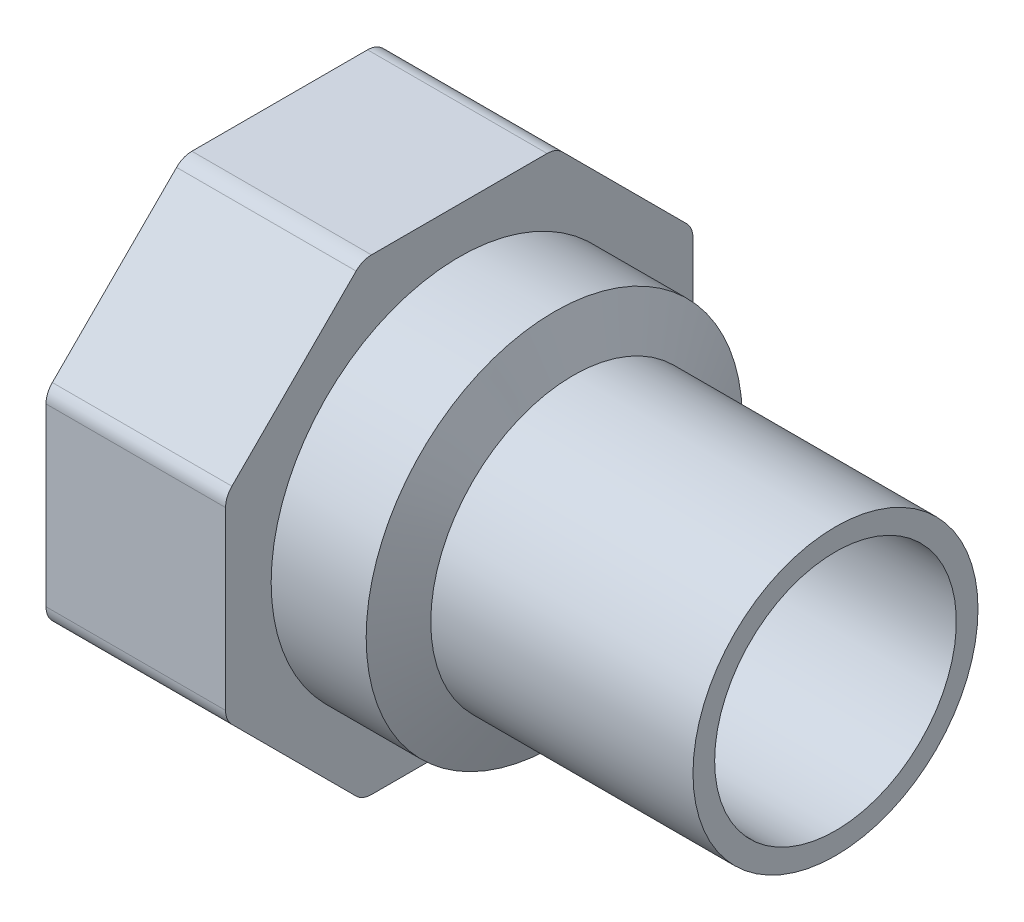
ISO-10303-21;
HEADER;
FILE_DESCRIPTION(('STEP AP214'),'2;1');
FILE_NAME('part.step','',(''),(''),'','','');
FILE_SCHEMA(('AUTOMOTIVE_DESIGN { 1 0 10303 214 1 1 1 1 }'));
ENDSEC;
DATA;
#1=APPLICATION_CONTEXT('core data for automotive mechanical design processes');
#2=APPLICATION_PROTOCOL_DEFINITION('international standard','automotive_design',2000,#1);
#3=PRODUCT_CONTEXT('',#1,'mechanical');
#4=PRODUCT('Part','Part','',(#3));
#5=PRODUCT_RELATED_PRODUCT_CATEGORY('part','',(#4));
#6=PRODUCT_DEFINITION_FORMATION('','',#4);
#7=PRODUCT_DEFINITION_CONTEXT('part definition',#1,'design');
#8=PRODUCT_DEFINITION('design','',#6,#7);
#9=PRODUCT_DEFINITION_SHAPE('','',#8);
#10=(LENGTH_UNIT() NAMED_UNIT(*) SI_UNIT(.MILLI.,.METRE.));
#11=(NAMED_UNIT(*) PLANE_ANGLE_UNIT() SI_UNIT($,.RADIAN.));
#12=(NAMED_UNIT(*) SI_UNIT($,.STERADIAN.) SOLID_ANGLE_UNIT());
#13=UNCERTAINTY_MEASURE_WITH_UNIT(LENGTH_MEASURE(1.E-05),#10,'distance_accuracy_value','');
#14=(GEOMETRIC_REPRESENTATION_CONTEXT(3) GLOBAL_UNCERTAINTY_ASSIGNED_CONTEXT((#13)) GLOBAL_UNIT_ASSIGNED_CONTEXT((#10,
#11,#12)) REPRESENTATION_CONTEXT('',''));
#15=CARTESIAN_POINT('',(0.,0.,0.));
#16=DIRECTION('',(0.,0.,1.));
#17=DIRECTION('',(1.,0.,0.));
#18=AXIS2_PLACEMENT_3D('',#15,#16,#17);
#19=CARTESIAN_POINT('',(-23.,0.,0.));
#20=DIRECTION('',(-1.,0.,0.));
#21=DIRECTION('',(0.,0.,1.));
#22=AXIS2_PLACEMENT_3D('',#19,#20,#21);
#23=CYLINDRICAL_SURFACE('',#22,12.5);
#24=CARTESIAN_POINT('',(-23.,0.,0.));
#25=DIRECTION('',(1.,0.,0.));
#26=DIRECTION('',(0.,1.,0.));
#27=AXIS2_PLACEMENT_3D('',#24,#25,#26);
#28=CIRCLE('',#27,12.5);
#29=CARTESIAN_POINT('',(-23.,12.5,0.));
#30=VERTEX_POINT('',#29);
#31=EDGE_CURVE('E317',#30,#30,#28,.F.);
#32=ORIENTED_EDGE('',*,*,#31,.F.);
#33=EDGE_LOOP('',(#32));
#34=FACE_BOUND('',#33,.T.);
#35=CARTESIAN_POINT('',(0.,0.,0.));
#36=DIRECTION('',(-1.,0.,0.));
#37=DIRECTION('',(0.,0.,1.));
#38=AXIS2_PLACEMENT_3D('',#35,#36,#37);
#39=CIRCLE('',#38,12.5);
#40=CARTESIAN_POINT('',(0.,0.,12.5));
#41=VERTEX_POINT('',#40);
#42=EDGE_CURVE('E18',#41,#41,#39,.F.);
#43=ORIENTED_EDGE('',*,*,#42,.F.);
#44=EDGE_LOOP('',(#43));
#45=FACE_BOUND('',#44,.T.);
#46=ADVANCED_FACE('F15',(#34,#45),#23,.T.);
#47=CARTESIAN_POINT('',(-23.,0.,0.));
#48=DIRECTION('',(-1.,0.,0.));
#49=DIRECTION('',(0.,0.,1.));
#50=AXIS2_PLACEMENT_3D('',#47,#48,#49);
#51=CONICAL_SURFACE('',#50,12.5,1.17600520709513);
#52=CARTESIAN_POINT('',(-24.6666666666667,0.,0.));
#53=DIRECTION('',(-1.,0.,0.));
#54=DIRECTION('',(0.,1.,0.));
#55=AXIS2_PLACEMENT_3D('',#52,#53,#54);
#56=CIRCLE('',#55,16.5);
#57=CARTESIAN_POINT('',(-24.6666666666667,16.5,0.));
#58=VERTEX_POINT('',#57);
#59=EDGE_CURVE('E309',#58,#58,#56,.T.);
#60=ORIENTED_EDGE('',*,*,#59,.F.);
#61=EDGE_LOOP('',(#60));
#62=FACE_BOUND('',#61,.T.);
#63=ORIENTED_EDGE('',*,*,#31,.T.);
#64=EDGE_LOOP('',(#63));
#65=FACE_BOUND('',#64,.T.);
#66=ADVANCED_FACE('F548',(#62,#65),#51,.T.);
#67=CARTESIAN_POINT('',(0.,12.5,12.6500021083112));
#68=DIRECTION('',(1.,0.,0.));
#69=DIRECTION('',(0.,-1.,0.));
#70=AXIS2_PLACEMENT_3D('',#67,#68,#69);
#71=PLANE('',#70);
#72=CARTESIAN_POINT('',(0.,0.,0.));
#73=DIRECTION('',(-1.,0.,0.));
#74=DIRECTION('',(0.,0.,1.));
#75=AXIS2_PLACEMENT_3D('',#72,#73,#74);
#76=CIRCLE('',#75,10.6);
#77=CARTESIAN_POINT('',(0.,0.,10.6));
#78=VERTEX_POINT('',#77);
#79=EDGE_CURVE('E137',#78,#78,#76,.F.);
#80=ORIENTED_EDGE('',*,*,#79,.F.);
#81=EDGE_LOOP('',(#80));
#82=FACE_BOUND('',#81,.T.);
#83=ORIENTED_EDGE('',*,*,#42,.T.);
#84=EDGE_LOOP('',(#83));
#85=FACE_BOUND('',#84,.T.);
#86=ADVANCED_FACE('F540',(#82,#85),#71,.T.);
#87=CARTESIAN_POINT('',(-33.,0.,0.));
#88=DIRECTION('',(-1.,0.,0.));
#89=DIRECTION('',(0.,0.,1.));
#90=AXIS2_PLACEMENT_3D('',#87,#88,#89);
#91=CYLINDRICAL_SURFACE('',#90,16.5);
#92=CARTESIAN_POINT('',(-33.,0.,0.));
#93=DIRECTION('',(-1.,0.,0.));
#94=DIRECTION('',(0.,0.,1.));
#95=AXIS2_PLACEMENT_3D('',#92,#93,#94);
#96=CIRCLE('',#95,16.5);
#97=CARTESIAN_POINT('',(-33.,0.,16.5));
#98=VERTEX_POINT('',#97);
#99=EDGE_CURVE('E285',#98,#98,#96,.T.);
#100=ORIENTED_EDGE('',*,*,#99,.F.);
#101=EDGE_LOOP('',(#100));
#102=FACE_BOUND('',#101,.T.);
#103=ORIENTED_EDGE('',*,*,#59,.T.);
#104=EDGE_LOOP('',(#103));
#105=FACE_BOUND('',#104,.T.);
#106=ADVANCED_FACE('F533',(#102,#105),#91,.T.);
#107=CARTESIAN_POINT('',(0.,0.,0.));
#108=DIRECTION('',(-1.,0.,0.));
#109=DIRECTION('',(0.,0.,1.));
#110=AXIS2_PLACEMENT_3D('',#107,#108,#109);
#111=CYLINDRICAL_SURFACE('',#110,10.6);
#112=ORIENTED_EDGE('',*,*,#79,.T.);
#113=EDGE_LOOP('',(#112));
#114=FACE_BOUND('',#113,.T.);
#115=CARTESIAN_POINT('',(-32.725923743948,0.,0.));
#116=DIRECTION('',(1.,0.,0.));
#117=DIRECTION('',(0.,1.,0.));
#118=AXIS2_PLACEMENT_3D('',#115,#116,#117);
#119=CIRCLE('',#118,10.6);
#120=CARTESIAN_POINT('',(-32.725923743948,10.6,0.));
#121=VERTEX_POINT('',#120);
#122=EDGE_CURVE('E165',#121,#121,#119,.T.);
#123=ORIENTED_EDGE('',*,*,#122,.F.);
#124=EDGE_LOOP('',(#123));
#125=FACE_BOUND('',#124,.T.);
#126=ADVANCED_FACE('F526',(#114,#125),#111,.F.);
#127=CARTESIAN_POINT('',(-33.,7.70437226013957,18.6));
#128=DIRECTION('',(1.,0.,0.));
#129=DIRECTION('',(0.,0.,-1.));
#130=AXIS2_PLACEMENT_3D('',#127,#128,#129);
#131=CYLINDRICAL_SURFACE('',#130,1.89999999999997);
#132=CARTESIAN_POINT('',(-48.75,7.70437226013957,18.6));
#133=DIRECTION('',(1.,0.,0.));
#134=DIRECTION('',(0.,0.,-1.));
#135=AXIS2_PLACEMENT_3D('',#132,#133,#134);
#136=CIRCLE('',#135,1.89999999999997);
#137=CARTESIAN_POINT('',(-48.75,9.047875144394,19.9435028842544));
#138=VERTEX_POINT('',#137);
#139=CARTESIAN_POINT('',(-48.75,7.70437226013957,20.5));
#140=VERTEX_POINT('',#139);
#141=EDGE_CURVE('E125',#138,#140,#136,.T.);
#142=ORIENTED_EDGE('',*,*,#141,.T.);
#143=DIRECTION('',(1.,0.,0.));
#144=VECTOR('',#143,1.);
#145=CARTESIAN_POINT('',(-48.75,7.70437226013956,20.5));
#146=LINE('',#145,#144);
#147=CARTESIAN_POINT('',(-33.,7.70437226013957,20.5));
#148=VERTEX_POINT('',#147);
#149=EDGE_CURVE('E131',#148,#140,#146,.F.);
#150=ORIENTED_EDGE('',*,*,#149,.F.);
#151=CARTESIAN_POINT('',(-33.,7.70437226013957,18.6));
#152=DIRECTION('',(1.,0.,0.));
#153=DIRECTION('',(0.,0.,-1.));
#154=AXIS2_PLACEMENT_3D('',#151,#152,#153);
#155=CIRCLE('',#154,1.89999999999997);
#156=CARTESIAN_POINT('',(-33.,9.04787514439399,19.9435028842544));
#157=VERTEX_POINT('',#156);
#158=EDGE_CURVE('E288',#157,#148,#155,.T.);
#159=ORIENTED_EDGE('',*,*,#158,.F.);
#160=DIRECTION('',(1.,0.,0.));
#161=VECTOR('',#160,1.);
#162=CARTESIAN_POINT('',(-48.75,9.047875144394,19.9435028842544));
#163=LINE('',#162,#161);
#164=EDGE_CURVE('E134',#138,#157,#163,.T.);
#165=ORIENTED_EDGE('',*,*,#164,.F.);
#166=EDGE_LOOP('',(#142,#150,#159,#165));
#167=FACE_BOUND('',#166,.T.);
#168=ADVANCED_FACE('F130',(#167),#131,.T.);
#169=CARTESIAN_POINT('',(-33.,18.6,7.70437226013958));
#170=DIRECTION('',(1.,0.,0.));
#171=DIRECTION('',(0.,0.,-1.));
#172=AXIS2_PLACEMENT_3D('',#169,#170,#171);
#173=CYLINDRICAL_SURFACE('',#172,1.89999999999999);
#174=CARTESIAN_POINT('',(-48.75,18.6,7.70437226013958));
#175=DIRECTION('',(1.,0.,0.));
#176=DIRECTION('',(0.,0.,-1.));
#177=AXIS2_PLACEMENT_3D('',#174,#175,#176);
#178=CIRCLE('',#177,1.89999999999999);
#179=CARTESIAN_POINT('',(-48.75,20.5,7.70437226013957));
#180=VERTEX_POINT('',#179);
#181=CARTESIAN_POINT('',(-48.75,19.9435028842544,9.04787514439401));
#182=VERTEX_POINT('',#181);
#183=EDGE_CURVE('E136',#180,#182,#178,.T.);
#184=ORIENTED_EDGE('',*,*,#183,.T.);
#185=DIRECTION('',(1.,0.,0.));
#186=VECTOR('',#185,1.);
#187=CARTESIAN_POINT('',(-48.75,19.9435028842544,9.04787514439401));
#188=LINE('',#187,#186);
#189=CARTESIAN_POINT('',(-33.,19.9435028842544,9.04787514439401));
#190=VERTEX_POINT('',#189);
#191=EDGE_CURVE('E170',#190,#182,#188,.F.);
#192=ORIENTED_EDGE('',*,*,#191,.F.);
#193=CARTESIAN_POINT('',(-33.,18.6,7.70437226013958));
#194=DIRECTION('',(1.,0.,0.));
#195=DIRECTION('',(0.,0.,-1.));
#196=AXIS2_PLACEMENT_3D('',#193,#194,#195);
#197=CIRCLE('',#196,1.89999999999999);
#198=CARTESIAN_POINT('',(-33.,20.5,7.70437226013957));
#199=VERTEX_POINT('',#198);
#200=EDGE_CURVE('E290',#199,#190,#197,.T.);
#201=ORIENTED_EDGE('',*,*,#200,.F.);
#202=DIRECTION('',(1.,0.,0.));
#203=VECTOR('',#202,1.);
#204=CARTESIAN_POINT('',(-48.75,20.5,7.70437226013956));
#205=LINE('',#204,#203);
#206=EDGE_CURVE('E178',#180,#199,#205,.T.);
#207=ORIENTED_EDGE('',*,*,#206,.F.);
#208=EDGE_LOOP('',(#184,#192,#201,#207));
#209=FACE_BOUND('',#208,.T.);
#210=ADVANCED_FACE('F511',(#209),#173,.T.);
#211=CARTESIAN_POINT('',(-33.,18.6,-7.70437226013955));
#212=DIRECTION('',(1.,0.,0.));
#213=DIRECTION('',(0.,0.,-1.));
#214=AXIS2_PLACEMENT_3D('',#211,#212,#213);
#215=CYLINDRICAL_SURFACE('',#214,1.89999999999999);
#216=CARTESIAN_POINT('',(-48.75,18.6,-7.70437226013955));
#217=DIRECTION('',(1.,0.,0.));
#218=DIRECTION('',(0.,0.,-1.));
#219=AXIS2_PLACEMENT_3D('',#216,#217,#218);
#220=CIRCLE('',#219,1.89999999999999);
#221=CARTESIAN_POINT('',(-48.75,19.9435028842544,-9.04787514439398));
#222=VERTEX_POINT('',#221);
#223=CARTESIAN_POINT('',(-48.75,20.5,-7.70437226013955));
#224=VERTEX_POINT('',#223);
#225=EDGE_CURVE('E306',#222,#224,#220,.T.);
#226=ORIENTED_EDGE('',*,*,#225,.T.);
#227=DIRECTION('',(1.,0.,0.));
#228=VECTOR('',#227,1.);
#229=CARTESIAN_POINT('',(-48.75,20.5,-7.70437226013955));
#230=LINE('',#229,#228);
#231=CARTESIAN_POINT('',(-33.,20.5,-7.70437226013955));
#232=VERTEX_POINT('',#231);
#233=EDGE_CURVE('E177',#232,#224,#230,.F.);
#234=ORIENTED_EDGE('',*,*,#233,.F.);
#235=CARTESIAN_POINT('',(-33.,18.6,-7.70437226013955));
#236=DIRECTION('',(1.,0.,0.));
#237=DIRECTION('',(0.,0.,-1.));
#238=AXIS2_PLACEMENT_3D('',#235,#236,#237);
#239=CIRCLE('',#238,1.89999999999999);
#240=CARTESIAN_POINT('',(-33.,19.9435028842544,-9.04787514439398));
#241=VERTEX_POINT('',#240);
#242=EDGE_CURVE('E292',#241,#232,#239,.T.);
#243=ORIENTED_EDGE('',*,*,#242,.F.);
#244=DIRECTION('',(1.,0.,0.));
#245=VECTOR('',#244,1.);
#246=CARTESIAN_POINT('',(-48.75,19.9435028842544,-9.04787514439398));
#247=LINE('',#246,#245);
#248=EDGE_CURVE('E187',#222,#241,#247,.T.);
#249=ORIENTED_EDGE('',*,*,#248,.F.);
#250=EDGE_LOOP('',(#226,#234,#243,#249));
#251=FACE_BOUND('',#250,.T.);
#252=ADVANCED_FACE('F503',(#251),#215,.T.);
#253=CARTESIAN_POINT('',(-33.,7.70437226013957,-18.6));
#254=DIRECTION('',(1.,0.,0.));
#255=DIRECTION('',(0.,0.,-1.));
#256=AXIS2_PLACEMENT_3D('',#253,#254,#255);
#257=CYLINDRICAL_SURFACE('',#256,1.89999999999999);
#258=CARTESIAN_POINT('',(-48.75,7.70437226013957,-18.6));
#259=DIRECTION('',(1.,0.,0.));
#260=DIRECTION('',(0.,0.,-1.));
#261=AXIS2_PLACEMENT_3D('',#258,#259,#260);
#262=CIRCLE('',#261,1.89999999999999);
#263=CARTESIAN_POINT('',(-48.75,7.70437226013956,-20.5));
#264=VERTEX_POINT('',#263);
#265=CARTESIAN_POINT('',(-48.75,9.04787514439401,-19.9435028842544));
#266=VERTEX_POINT('',#265);
#267=EDGE_CURVE('E304',#264,#266,#262,.T.);
#268=ORIENTED_EDGE('',*,*,#267,.T.);
#269=DIRECTION('',(1.,0.,0.));
#270=VECTOR('',#269,1.);
#271=CARTESIAN_POINT('',(-48.75,9.04787514439401,-19.9435028842544));
#272=LINE('',#271,#270);
#273=CARTESIAN_POINT('',(-33.,9.047875144394,-19.9435028842544));
#274=VERTEX_POINT('',#273);
#275=EDGE_CURVE('E186',#274,#266,#272,.F.);
#276=ORIENTED_EDGE('',*,*,#275,.F.);
#277=CARTESIAN_POINT('',(-33.,7.70437226013957,-18.6));
#278=DIRECTION('',(1.,0.,0.));
#279=DIRECTION('',(0.,0.,-1.));
#280=AXIS2_PLACEMENT_3D('',#277,#278,#279);
#281=CIRCLE('',#280,1.89999999999999);
#282=CARTESIAN_POINT('',(-33.,7.70437226013957,-20.5));
#283=VERTEX_POINT('',#282);
#284=EDGE_CURVE('E294',#283,#274,#281,.T.);
#285=ORIENTED_EDGE('',*,*,#284,.F.);
#286=DIRECTION('',(1.,0.,0.));
#287=VECTOR('',#286,1.);
#288=CARTESIAN_POINT('',(-48.75,7.70437226013956,-20.5));
#289=LINE('',#288,#287);
#290=EDGE_CURVE('E196',#264,#283,#289,.T.);
#291=ORIENTED_EDGE('',*,*,#290,.F.);
#292=EDGE_LOOP('',(#268,#276,#285,#291));
#293=FACE_BOUND('',#292,.T.);
#294=ADVANCED_FACE('F495',(#293),#257,.T.);
#295=CARTESIAN_POINT('',(-33.,-7.70437226013956,-18.6));
#296=DIRECTION('',(1.,0.,0.));
#297=DIRECTION('',(0.,0.,-1.));
#298=AXIS2_PLACEMENT_3D('',#295,#296,#297);
#299=CYLINDRICAL_SURFACE('',#298,1.89999999999997);
#300=CARTESIAN_POINT('',(-48.75,-7.70437226013956,-18.6));
#301=DIRECTION('',(1.,0.,0.));
#302=DIRECTION('',(0.,0.,-1.));
#303=AXIS2_PLACEMENT_3D('',#300,#301,#302);
#304=CIRCLE('',#303,1.89999999999997);
#305=CARTESIAN_POINT('',(-48.75,-9.04787514439399,-19.9435028842544));
#306=VERTEX_POINT('',#305);
#307=CARTESIAN_POINT('',(-48.75,-7.70437226013956,-20.5));
#308=VERTEX_POINT('',#307);
#309=EDGE_CURVE('E302',#306,#308,#304,.T.);
#310=ORIENTED_EDGE('',*,*,#309,.T.);
#311=DIRECTION('',(1.,0.,0.));
#312=VECTOR('',#311,1.);
#313=CARTESIAN_POINT('',(-48.75,-7.70437226013956,-20.5));
#314=LINE('',#313,#312);
#315=CARTESIAN_POINT('',(-33.,-7.70437226013956,-20.5));
#316=VERTEX_POINT('',#315);
#317=EDGE_CURVE('E195',#316,#308,#314,.F.);
#318=ORIENTED_EDGE('',*,*,#317,.F.);
#319=CARTESIAN_POINT('',(-33.,-7.70437226013956,-18.6));
#320=DIRECTION('',(1.,0.,0.));
#321=DIRECTION('',(0.,0.,-1.));
#322=AXIS2_PLACEMENT_3D('',#319,#320,#321);
#323=CIRCLE('',#322,1.89999999999997);
#324=CARTESIAN_POINT('',(-33.,-9.04787514439398,-19.9435028842544));
#325=VERTEX_POINT('',#324);
#326=EDGE_CURVE('E296',#325,#316,#323,.T.);
#327=ORIENTED_EDGE('',*,*,#326,.F.);
#328=DIRECTION('',(1.,0.,0.));
#329=VECTOR('',#328,1.);
#330=CARTESIAN_POINT('',(-48.75,-9.04787514439399,-19.9435028842544));
#331=LINE('',#330,#329);
#332=EDGE_CURVE('E205',#306,#325,#331,.T.);
#333=ORIENTED_EDGE('',*,*,#332,.F.);
#334=EDGE_LOOP('',(#310,#318,#327,#333));
#335=FACE_BOUND('',#334,.T.);
#336=ADVANCED_FACE('F487',(#335),#299,.T.);
#337=CARTESIAN_POINT('',(-33.,-18.6,-7.70437226013958));
#338=DIRECTION('',(1.,0.,0.));
#339=DIRECTION('',(0.,0.,-1.));
#340=AXIS2_PLACEMENT_3D('',#337,#338,#339);
#341=CYLINDRICAL_SURFACE('',#340,1.89999999999999);
#342=CARTESIAN_POINT('',(-48.75,-18.6,-7.70437226013958));
#343=DIRECTION('',(1.,0.,0.));
#344=DIRECTION('',(0.,0.,-1.));
#345=AXIS2_PLACEMENT_3D('',#342,#343,#344);
#346=CIRCLE('',#345,1.89999999999999);
#347=CARTESIAN_POINT('',(-48.75,-20.5,-7.70437226013958));
#348=VERTEX_POINT('',#347);
#349=CARTESIAN_POINT('',(-48.75,-19.9435028842544,-9.04787514439401));
#350=VERTEX_POINT('',#349);
#351=EDGE_CURVE('E300',#348,#350,#346,.T.);
#352=ORIENTED_EDGE('',*,*,#351,.T.);
#353=DIRECTION('',(1.,0.,0.));
#354=VECTOR('',#353,1.);
#355=CARTESIAN_POINT('',(-48.75,-19.9435028842544,-9.04787514439402));
#356=LINE('',#355,#354);
#357=CARTESIAN_POINT('',(-33.,-19.9435028842544,-9.04787514439402));
#358=VERTEX_POINT('',#357);
#359=EDGE_CURVE('E204',#358,#350,#356,.F.);
#360=ORIENTED_EDGE('',*,*,#359,.F.);
#361=CARTESIAN_POINT('',(-33.,-18.6,-7.70437226013958));
#362=DIRECTION('',(1.,0.,0.));
#363=DIRECTION('',(0.,0.,-1.));
#364=AXIS2_PLACEMENT_3D('',#361,#362,#363);
#365=CIRCLE('',#364,1.89999999999999);
#366=CARTESIAN_POINT('',(-33.,-20.5,-7.70437226013958));
#367=VERTEX_POINT('',#366);
#368=EDGE_CURVE('E298',#367,#358,#365,.T.);
#369=ORIENTED_EDGE('',*,*,#368,.F.);
#370=DIRECTION('',(1.,0.,0.));
#371=VECTOR('',#370,1.);
#372=CARTESIAN_POINT('',(-48.75,-20.5,-7.70437226013958));
#373=LINE('',#372,#371);
#374=EDGE_CURVE('E211',#348,#367,#373,.T.);
#375=ORIENTED_EDGE('',*,*,#374,.F.);
#376=EDGE_LOOP('',(#352,#360,#369,#375));
#377=FACE_BOUND('',#376,.T.);
#378=ADVANCED_FACE('F479',(#377),#341,.T.);
#379=CARTESIAN_POINT('',(-33.,20.5,20.5));
#380=DIRECTION('',(1.,0.,0.));
#381=DIRECTION('',(0.,-1.,0.));
#382=AXIS2_PLACEMENT_3D('',#379,#380,#381);
#383=PLANE('',#382);
#384=ORIENTED_EDGE('',*,*,#99,.T.);
#385=EDGE_LOOP('',(#384));
#386=FACE_BOUND('',#385,.T.);
#387=ORIENTED_EDGE('',*,*,#158,.T.);
#388=DIRECTION('',(0.,1.,0.));
#389=VECTOR('',#388,1.);
#390=CARTESIAN_POINT('',(-33.,0.,20.5));
#391=LINE('',#390,#389);
#392=CARTESIAN_POINT('',(-33.,-7.70437226013956,20.5));
#393=VERTEX_POINT('',#392);
#394=EDGE_CURVE('E144',#393,#148,#391,.T.);
#395=ORIENTED_EDGE('',*,*,#394,.F.);
#396=CARTESIAN_POINT('',(-33.,-7.70437226013956,18.6));
#397=DIRECTION('',(1.,0.,0.));
#398=DIRECTION('',(0.,0.,-1.));
#399=AXIS2_PLACEMENT_3D('',#396,#397,#398);
#400=CIRCLE('',#399,1.89999999999999);
#401=CARTESIAN_POINT('',(-33.,-9.04787514439399,19.9435028842544));
#402=VERTEX_POINT('',#401);
#403=EDGE_CURVE('E276',#402,#393,#400,.F.);
#404=ORIENTED_EDGE('',*,*,#403,.F.);
#405=DIRECTION('',(0.,0.707106781186548,0.707106781186547));
#406=VECTOR('',#405,1.);
#407=CARTESIAN_POINT('',(-33.,-14.4956890143242,14.4956890143242));
#408=LINE('',#407,#406);
#409=CARTESIAN_POINT('',(-33.,-19.9435028842544,9.04787514439399));
#410=VERTEX_POINT('',#409);
#411=EDGE_CURVE('E164',#410,#402,#408,.T.);
#412=ORIENTED_EDGE('',*,*,#411,.F.);
#413=CARTESIAN_POINT('',(-33.,-18.6,7.70437226013955));
#414=DIRECTION('',(1.,0.,0.));
#415=DIRECTION('',(0.,0.,-1.));
#416=AXIS2_PLACEMENT_3D('',#413,#414,#415);
#417=CIRCLE('',#416,1.89999999999999);
#418=CARTESIAN_POINT('',(-33.,-20.5,7.70437226013954));
#419=VERTEX_POINT('',#418);
#420=EDGE_CURVE('E273',#419,#410,#417,.F.);
#421=ORIENTED_EDGE('',*,*,#420,.F.);
#422=DIRECTION('',(0.,0.,1.));
#423=VECTOR('',#422,1.);
#424=CARTESIAN_POINT('',(-33.,-20.5,0.));
#425=LINE('',#424,#423);
#426=EDGE_CURVE('E208',#367,#419,#425,.T.);
#427=ORIENTED_EDGE('',*,*,#426,.F.);
#428=ORIENTED_EDGE('',*,*,#368,.T.);
#429=DIRECTION('',(0.,-0.707106781186548,0.707106781186547));
#430=VECTOR('',#429,1.);
#431=CARTESIAN_POINT('',(-33.,-14.4956890143242,-14.4956890143242));
#432=LINE('',#431,#430);
#433=EDGE_CURVE('E199',#325,#358,#432,.T.);
#434=ORIENTED_EDGE('',*,*,#433,.F.);
#435=ORIENTED_EDGE('',*,*,#326,.T.);
#436=DIRECTION('',(0.,-1.,0.));
#437=VECTOR('',#436,1.);
#438=CARTESIAN_POINT('',(-33.,0.,-20.5));
#439=LINE('',#438,#437);
#440=EDGE_CURVE('E190',#283,#316,#439,.T.);
#441=ORIENTED_EDGE('',*,*,#440,.F.);
#442=ORIENTED_EDGE('',*,*,#284,.T.);
#443=DIRECTION('',(0.,-0.707106781186547,-0.707106781186548));
#444=VECTOR('',#443,1.);
#445=CARTESIAN_POINT('',(-33.,14.4956890143242,-14.4956890143242));
#446=LINE('',#445,#444);
#447=EDGE_CURVE('E181',#241,#274,#446,.T.);
#448=ORIENTED_EDGE('',*,*,#447,.F.);
#449=ORIENTED_EDGE('',*,*,#242,.T.);
#450=DIRECTION('',(0.,0.,-1.));
#451=VECTOR('',#450,1.);
#452=CARTESIAN_POINT('',(-33.,20.5,0.));
#453=LINE('',#452,#451);
#454=EDGE_CURVE('E172',#199,#232,#453,.T.);
#455=ORIENTED_EDGE('',*,*,#454,.F.);
#456=ORIENTED_EDGE('',*,*,#200,.T.);
#457=DIRECTION('',(0.,0.707106781186548,-0.707106781186547));
#458=VECTOR('',#457,1.);
#459=CARTESIAN_POINT('',(-33.,14.4956890143242,14.4956890143242));
#460=LINE('',#459,#458);
#461=EDGE_CURVE('E167',#157,#190,#460,.T.);
#462=ORIENTED_EDGE('',*,*,#461,.F.);
#463=EDGE_LOOP('',(#387,#395,#404,#412,#421,#427,#428,#434,#435,#441,#442,#448,#449,#455,#456,#462));
#464=FACE_BOUND('',#463,.T.);
#465=ADVANCED_FACE('F271',(#386,#464),#383,.T.);
#466=CARTESIAN_POINT('',(-33.,-7.70437226013956,18.6));
#467=DIRECTION('',(1.,0.,0.));
#468=DIRECTION('',(0.,0.,-1.));
#469=AXIS2_PLACEMENT_3D('',#466,#467,#468);
#470=CYLINDRICAL_SURFACE('',#469,1.89999999999999);
#471=CARTESIAN_POINT('',(-48.75,-7.70437226013956,18.6));
#472=DIRECTION('',(1.,0.,0.));
#473=DIRECTION('',(0.,0.,-1.));
#474=AXIS2_PLACEMENT_3D('',#471,#472,#473);
#475=CIRCLE('',#474,1.89999999999999);
#476=CARTESIAN_POINT('',(-48.75,-7.70437226013956,20.5));
#477=VERTEX_POINT('',#476);
#478=CARTESIAN_POINT('',(-48.75,-9.047875144394,19.9435028842544));
#479=VERTEX_POINT('',#478);
#480=EDGE_CURVE('E148',#477,#479,#475,.T.);
#481=ORIENTED_EDGE('',*,*,#480,.T.);
#482=DIRECTION('',(1.,0.,0.));
#483=VECTOR('',#482,1.);
#484=CARTESIAN_POINT('',(-48.75,-9.047875144394,19.9435028842544));
#485=LINE('',#484,#483);
#486=EDGE_CURVE('E161',#402,#479,#485,.F.);
#487=ORIENTED_EDGE('',*,*,#486,.F.);
#488=ORIENTED_EDGE('',*,*,#403,.T.);
#489=DIRECTION('',(1.,0.,0.));
#490=VECTOR('',#489,1.);
#491=CARTESIAN_POINT('',(-48.75,-7.70437226013956,20.5));
#492=LINE('',#491,#490);
#493=EDGE_CURVE('E145',#477,#393,#492,.T.);
#494=ORIENTED_EDGE('',*,*,#493,.F.);
#495=EDGE_LOOP('',(#481,#487,#488,#494));
#496=FACE_BOUND('',#495,.T.);
#497=ADVANCED_FACE('F465',(#496),#470,.T.);
#498=CARTESIAN_POINT('',(-33.,-18.6,7.70437226013955));
#499=DIRECTION('',(1.,0.,0.));
#500=DIRECTION('',(0.,0.,-1.));
#501=AXIS2_PLACEMENT_3D('',#498,#499,#500);
#502=CYLINDRICAL_SURFACE('',#501,1.89999999999999);
#503=CARTESIAN_POINT('',(-48.75,-18.6,7.70437226013955));
#504=DIRECTION('',(1.,0.,0.));
#505=DIRECTION('',(0.,0.,-1.));
#506=AXIS2_PLACEMENT_3D('',#503,#504,#505);
#507=CIRCLE('',#506,1.89999999999999);
#508=CARTESIAN_POINT('',(-48.75,-19.9435028842544,9.04787514439399));
#509=VERTEX_POINT('',#508);
#510=CARTESIAN_POINT('',(-48.75,-20.5,7.70437226013954));
#511=VERTEX_POINT('',#510);
#512=EDGE_CURVE('E33',#509,#511,#507,.T.);
#513=ORIENTED_EDGE('',*,*,#512,.T.);
#514=DIRECTION('',(1.,0.,0.));
#515=VECTOR('',#514,1.);
#516=CARTESIAN_POINT('',(-48.75,-20.5,7.70437226013954));
#517=LINE('',#516,#515);
#518=EDGE_CURVE('E214',#419,#511,#517,.F.);
#519=ORIENTED_EDGE('',*,*,#518,.F.);
#520=ORIENTED_EDGE('',*,*,#420,.T.);
#521=DIRECTION('',(1.,0.,0.));
#522=VECTOR('',#521,1.);
#523=CARTESIAN_POINT('',(-48.75,-19.9435028842544,9.04787514439399));
#524=LINE('',#523,#522);
#525=EDGE_CURVE('E156',#509,#410,#524,.T.);
#526=ORIENTED_EDGE('',*,*,#525,.F.);
#527=EDGE_LOOP('',(#513,#519,#520,#526));
#528=FACE_BOUND('',#527,.T.);
#529=ADVANCED_FACE('F278',(#528),#502,.T.);
#530=CARTESIAN_POINT('',(-33.,0.,0.));
#531=DIRECTION('',(-1.,0.,0.));
#532=DIRECTION('',(0.,0.,1.));
#533=AXIS2_PLACEMENT_3D('',#530,#531,#532);
#534=CONICAL_SURFACE('',#533,11.0747140006303,1.0471975511966);
#535=ORIENTED_EDGE('',*,*,#122,.T.);
#536=EDGE_LOOP('',(#535));
#537=FACE_BOUND('',#536,.T.);
#538=CARTESIAN_POINT('',(-33.,0.,0.));
#539=DIRECTION('',(1.,0.,0.));
#540=DIRECTION('',(0.,1.,0.));
#541=AXIS2_PLACEMENT_3D('',#538,#539,#540);
#542=CIRCLE('',#541,11.0747140006303);
#543=CARTESIAN_POINT('',(-33.,11.0747140006303,0.));
#544=VERTEX_POINT('',#543);
#545=EDGE_CURVE('E151',#544,#544,#542,.T.);
#546=ORIENTED_EDGE('',*,*,#545,.F.);
#547=EDGE_LOOP('',(#546));
#548=FACE_BOUND('',#547,.T.);
#549=ADVANCED_FACE('F451',(#537,#548),#534,.F.);
#550=CARTESIAN_POINT('',(-48.75,7.70437226013956,20.5));
#551=DIRECTION('',(0.,0.,1.));
#552=DIRECTION('',(0.,-1.,0.));
#553=AXIS2_PLACEMENT_3D('',#550,#551,#552);
#554=PLANE('',#553);
#555=DIRECTION('',(0.,1.,0.));
#556=VECTOR('',#555,1.);
#557=CARTESIAN_POINT('',(-48.75,0.,20.5));
#558=LINE('',#557,#556);
#559=EDGE_CURVE('E143',#477,#140,#558,.T.);
#560=ORIENTED_EDGE('',*,*,#559,.F.);
#561=ORIENTED_EDGE('',*,*,#493,.T.);
#562=ORIENTED_EDGE('',*,*,#394,.T.);
#563=ORIENTED_EDGE('',*,*,#149,.T.);
#564=EDGE_LOOP('',(#560,#561,#562,#563));
#565=FACE_BOUND('',#564,.T.);
#566=ADVANCED_FACE('F141',(#565),#554,.T.);
#567=CARTESIAN_POINT('',(-48.75,19.9435028842544,9.04787514439401));
#568=DIRECTION('',(0.,0.707106781186547,0.707106781186548));
#569=DIRECTION('',(0.,-0.707106781186548,0.707106781186547));
#570=AXIS2_PLACEMENT_3D('',#567,#568,#569);
#571=PLANE('',#570);
#572=CARTESIAN_POINT('',(-48.75,9.047875144394,19.9435028842544));
#573=CARTESIAN_POINT('',(-48.75,9.50185963355485,19.4895183950936));
#574=CARTESIAN_POINT('',(-48.75,9.9558441227157,19.0355339059327));
#575=CARTESIAN_POINT('',(-48.75,10.8638131010374,18.127564927611));
#576=CARTESIAN_POINT('',(-48.75,11.3177975901983,17.6735804384502));
#577=CARTESIAN_POINT('',(-48.75,12.22576656852,16.7656114601285));
#578=CARTESIAN_POINT('',(-48.75,12.6797510576808,16.3116269709676));
#579=CARTESIAN_POINT('',(-48.75,13.5877200360025,15.4036579926459));
#580=CARTESIAN_POINT('',(-48.75,14.0417045251634,14.9496735034851));
#581=CARTESIAN_POINT('',(-48.75,14.9496735034851,14.0417045251634));
#582=CARTESIAN_POINT('',(-48.75,15.4036579926459,13.5877200360025));
#583=CARTESIAN_POINT('',(-48.75,16.3116269709676,12.6797510576808));
#584=CARTESIAN_POINT('',(-48.75,16.7656114601285,12.22576656852));
#585=CARTESIAN_POINT('',(-48.75,17.6735804384502,11.3177975901983));
#586=CARTESIAN_POINT('',(-48.75,18.127564927611,10.8638131010374));
#587=CARTESIAN_POINT('',(-48.75,19.0355339059327,9.95584412271571));
#588=CARTESIAN_POINT('',(-48.75,19.4895183950936,9.50185963355486));
#589=CARTESIAN_POINT('',(-48.75,19.9435028842544,9.04787514439401));
#590=B_SPLINE_CURVE_WITH_KNOTS('',3,(#572,#573,#574,#575,#576,#577,#578,#579,#580,#581,#582,
#583,#584,#585,#586,#587,#588,#589),.UNSPECIFIED.,.F.,.F.,(4,2,2,2,2,2,2,2,4),(0.,
1.92609306503489,3.85218613006978,5.77827919510467,7.70437226013956,9.63046532517446,
11.5565583902093,13.4826514552442,15.4087445202791),.UNSPECIFIED.);
#591=EDGE_CURVE('E150',#138,#182,#590,.T.);
#592=ORIENTED_EDGE('',*,*,#591,.F.);
#593=ORIENTED_EDGE('',*,*,#164,.T.);
#594=ORIENTED_EDGE('',*,*,#461,.T.);
#595=ORIENTED_EDGE('',*,*,#191,.T.);
#596=EDGE_LOOP('',(#592,#593,#594,#595));
#597=FACE_BOUND('',#596,.T.);
#598=ADVANCED_FACE('F436',(#597),#571,.T.);
#599=CARTESIAN_POINT('',(-48.75,20.5,-7.70437226013955));
#600=DIRECTION('',(0.,1.,0.));
#601=DIRECTION('',(0.,0.,1.));
#602=AXIS2_PLACEMENT_3D('',#599,#600,#601);
#603=PLANE('',#602);
#604=DIRECTION('',(0.,0.,-1.));
#605=VECTOR('',#604,1.);
#606=CARTESIAN_POINT('',(-48.75,20.5,20.5));
#607=LINE('',#606,#605);
#608=EDGE_CURVE('E153',#180,#224,#607,.T.);
#609=ORIENTED_EDGE('',*,*,#608,.F.);
#610=ORIENTED_EDGE('',*,*,#206,.T.);
#611=ORIENTED_EDGE('',*,*,#454,.T.);
#612=ORIENTED_EDGE('',*,*,#233,.T.);
#613=EDGE_LOOP('',(#609,#610,#611,#612));
#614=FACE_BOUND('',#613,.T.);
#615=ADVANCED_FACE('F428',(#614),#603,.T.);
#616=CARTESIAN_POINT('',(-48.75,9.04787514439401,-19.9435028842544));
#617=DIRECTION('',(0.,0.707106781186548,-0.707106781186547));
#618=DIRECTION('',(0.,0.707106781186547,0.707106781186548));
#619=AXIS2_PLACEMENT_3D('',#616,#617,#618);
#620=PLANE('',#619);
#621=CARTESIAN_POINT('',(-48.75,19.9435028842544,-9.04787514439399));
#622=CARTESIAN_POINT('',(-48.75,19.4895183950936,-9.50185963355484));
#623=CARTESIAN_POINT('',(-48.75,19.0355339059327,-9.95584412271569));
#624=CARTESIAN_POINT('',(-48.75,18.127564927611,-10.8638131010374));
#625=CARTESIAN_POINT('',(-48.75,17.6735804384502,-11.3177975901982));
#626=CARTESIAN_POINT('',(-48.75,16.7656114601285,-12.22576656852));
#627=CARTESIAN_POINT('',(-48.75,16.3116269709676,-12.6797510576808));
#628=CARTESIAN_POINT('',(-48.75,15.4036579926459,-13.5877200360025));
#629=CARTESIAN_POINT('',(-48.75,14.9496735034851,-14.0417045251634));
#630=CARTESIAN_POINT('',(-48.75,14.0417045251634,-14.9496735034851));
#631=CARTESIAN_POINT('',(-48.75,13.5877200360025,-15.4036579926459));
#632=CARTESIAN_POINT('',(-48.75,12.6797510576808,-16.3116269709676));
#633=CARTESIAN_POINT('',(-48.75,12.22576656852,-16.7656114601285));
#634=CARTESIAN_POINT('',(-48.75,11.3177975901983,-17.6735804384502));
#635=CARTESIAN_POINT('',(-48.75,10.8638131010374,-18.127564927611));
#636=CARTESIAN_POINT('',(-48.75,9.9558441227157,-19.0355339059327));
#637=CARTESIAN_POINT('',(-48.75,9.50185963355485,-19.4895183950936));
#638=CARTESIAN_POINT('',(-48.75,9.047875144394,-19.9435028842544));
#639=B_SPLINE_CURVE_WITH_KNOTS('',3,(#621,#622,#623,#624,#625,#626,#627,#628,#629,#630,#631,
#632,#633,#634,#635,#636,#637,#638),.UNSPECIFIED.,.F.,.F.,(4,2,2,2,2,2,2,2,4),(0.,
1.9260930650349,3.85218613006979,5.77827919510468,7.70437226013958,9.63046532517447,
11.5565583902094,13.4826514552443,15.4087445202792),.UNSPECIFIED.);
#640=EDGE_CURVE('E587',#222,#266,#639,.T.);
#641=ORIENTED_EDGE('',*,*,#640,.F.);
#642=ORIENTED_EDGE('',*,*,#248,.T.);
#643=ORIENTED_EDGE('',*,*,#447,.T.);
#644=ORIENTED_EDGE('',*,*,#275,.T.);
#645=EDGE_LOOP('',(#641,#642,#643,#644));
#646=FACE_BOUND('',#645,.T.);
#647=ADVANCED_FACE('F420',(#646),#620,.T.);
#648=CARTESIAN_POINT('',(-48.75,-7.70437226013956,-20.5));
#649=DIRECTION('',(0.,0.,-1.));
#650=DIRECTION('',(0.,1.,0.));
#651=AXIS2_PLACEMENT_3D('',#648,#649,#650);
#652=PLANE('',#651);
#653=DIRECTION('',(0.,-1.,0.));
#654=VECTOR('',#653,1.);
#655=CARTESIAN_POINT('',(-48.75,0.,-20.5));
#656=LINE('',#655,#654);
#657=EDGE_CURVE('E221',#264,#308,#656,.T.);
#658=ORIENTED_EDGE('',*,*,#657,.F.);
#659=ORIENTED_EDGE('',*,*,#290,.T.);
#660=ORIENTED_EDGE('',*,*,#440,.T.);
#661=ORIENTED_EDGE('',*,*,#317,.T.);
#662=EDGE_LOOP('',(#658,#659,#660,#661));
#663=FACE_BOUND('',#662,.T.);
#664=ADVANCED_FACE('F412',(#663),#652,.T.);
#665=CARTESIAN_POINT('',(-48.75,-19.9435028842544,-9.04787514439402));
#666=DIRECTION('',(0.,-0.707106781186547,-0.707106781186548));
#667=DIRECTION('',(0.,0.707106781186548,-0.707106781186547));
#668=AXIS2_PLACEMENT_3D('',#665,#666,#667);
#669=PLANE('',#668);
#670=CARTESIAN_POINT('',(-48.75,-9.04787514439399,-19.9435028842544));
#671=CARTESIAN_POINT('',(-48.75,-9.50185963355484,-19.4895183950936));
#672=CARTESIAN_POINT('',(-48.75,-9.95584412271569,-19.0355339059327));
#673=CARTESIAN_POINT('',(-48.75,-10.8638131010374,-18.127564927611));
#674=CARTESIAN_POINT('',(-48.75,-11.3177975901982,-17.6735804384502));
#675=CARTESIAN_POINT('',(-48.75,-12.22576656852,-16.7656114601285));
#676=CARTESIAN_POINT('',(-48.75,-12.6797510576808,-16.3116269709676));
#677=CARTESIAN_POINT('',(-48.75,-13.5877200360025,-15.4036579926459));
#678=CARTESIAN_POINT('',(-48.75,-14.0417045251634,-14.9496735034851));
#679=CARTESIAN_POINT('',(-48.75,-14.9496735034851,-14.0417045251634));
#680=CARTESIAN_POINT('',(-48.75,-15.4036579926459,-13.5877200360025));
#681=CARTESIAN_POINT('',(-48.75,-16.3116269709676,-12.6797510576808));
#682=CARTESIAN_POINT('',(-48.75,-16.7656114601285,-12.22576656852));
#683=CARTESIAN_POINT('',(-48.75,-17.6735804384502,-11.3177975901983));
#684=CARTESIAN_POINT('',(-48.75,-18.127564927611,-10.8638131010374));
#685=CARTESIAN_POINT('',(-48.75,-19.0355339059327,-9.95584412271572));
#686=CARTESIAN_POINT('',(-48.75,-19.4895183950936,-9.50185963355487));
#687=CARTESIAN_POINT('',(-48.75,-19.9435028842544,-9.04787514439402));
#688=B_SPLINE_CURVE_WITH_KNOTS('',3,(#670,#671,#672,#673,#674,#675,#676,#677,#678,#679,#680,
#681,#682,#683,#684,#685,#686,#687),.UNSPECIFIED.,.F.,.F.,(4,2,2,2,2,2,2,2,4),(0.,
1.92609306503489,3.85218613006978,5.77827919510468,7.70437226013957,9.63046532517446,
11.5565583902094,13.4826514552443,15.4087445202791),.UNSPECIFIED.);
#689=EDGE_CURVE('E215',#306,#350,#688,.T.);
#690=ORIENTED_EDGE('',*,*,#689,.F.);
#691=ORIENTED_EDGE('',*,*,#332,.T.);
#692=ORIENTED_EDGE('',*,*,#433,.T.);
#693=ORIENTED_EDGE('',*,*,#359,.T.);
#694=EDGE_LOOP('',(#690,#691,#692,#693));
#695=FACE_BOUND('',#694,.T.);
#696=ADVANCED_FACE('F404',(#695),#669,.T.);
#697=CARTESIAN_POINT('',(-48.75,-20.5,7.70437226013954));
#698=DIRECTION('',(0.,-1.,0.));
#699=DIRECTION('',(0.,0.,-1.));
#700=AXIS2_PLACEMENT_3D('',#697,#698,#699);
#701=PLANE('',#700);
#702=DIRECTION('',(0.,0.,-1.));
#703=VECTOR('',#702,1.);
#704=CARTESIAN_POINT('',(-48.75,-20.5,20.5));
#705=LINE('',#704,#703);
#706=EDGE_CURVE('E220',#348,#511,#705,.F.);
#707=ORIENTED_EDGE('',*,*,#706,.F.);
#708=ORIENTED_EDGE('',*,*,#374,.T.);
#709=ORIENTED_EDGE('',*,*,#426,.T.);
#710=ORIENTED_EDGE('',*,*,#518,.T.);
#711=EDGE_LOOP('',(#707,#708,#709,#710));
#712=FACE_BOUND('',#711,.T.);
#713=ADVANCED_FACE('F397',(#712),#701,.T.);
#714=CARTESIAN_POINT('',(-48.75,-9.047875144394,19.9435028842544));
#715=DIRECTION('',(0.,-0.707106781186547,0.707106781186548));
#716=DIRECTION('',(0.,-0.707106781186548,-0.707106781186547));
#717=AXIS2_PLACEMENT_3D('',#714,#715,#716);
#718=PLANE('',#717);
#719=CARTESIAN_POINT('',(-48.75,-19.9435028842544,9.04787514439399));
#720=CARTESIAN_POINT('',(-48.75,-19.4895183950936,9.50185963355484));
#721=CARTESIAN_POINT('',(-48.75,-19.0355339059327,9.95584412271569));
#722=CARTESIAN_POINT('',(-48.75,-18.127564927611,10.8638131010374));
#723=CARTESIAN_POINT('',(-48.75,-17.6735804384502,11.3177975901982));
#724=CARTESIAN_POINT('',(-48.75,-16.7656114601285,12.22576656852));
#725=CARTESIAN_POINT('',(-48.75,-16.3116269709676,12.6797510576808));
#726=CARTESIAN_POINT('',(-48.75,-15.4036579926459,13.5877200360025));
#727=CARTESIAN_POINT('',(-48.75,-14.9496735034851,14.0417045251634));
#728=CARTESIAN_POINT('',(-48.75,-14.0417045251634,14.9496735034851));
#729=CARTESIAN_POINT('',(-48.75,-13.5877200360025,15.4036579926459));
#730=CARTESIAN_POINT('',(-48.75,-12.6797510576808,16.3116269709676));
#731=CARTESIAN_POINT('',(-48.75,-12.22576656852,16.7656114601285));
#732=CARTESIAN_POINT('',(-48.75,-11.3177975901983,17.6735804384502));
#733=CARTESIAN_POINT('',(-48.75,-10.8638131010374,18.127564927611));
#734=CARTESIAN_POINT('',(-48.75,-9.95584412271571,19.0355339059327));
#735=CARTESIAN_POINT('',(-48.75,-9.50185963355486,19.4895183950936));
#736=CARTESIAN_POINT('',(-48.75,-9.047875144394,19.9435028842544));
#737=B_SPLINE_CURVE_WITH_KNOTS('',3,(#719,#720,#721,#722,#723,#724,#725,#726,#727,#728,#729,
#730,#731,#732,#733,#734,#735,#736),.UNSPECIFIED.,.F.,.F.,(4,2,2,2,2,2,2,2,4),(0.,
1.9260930650349,3.85218613006979,5.77827919510468,7.70437226013958,9.63046532517447,
11.5565583902094,13.4826514552443,15.4087445202792),.UNSPECIFIED.);
#738=EDGE_CURVE('E247',#509,#479,#737,.T.);
#739=ORIENTED_EDGE('',*,*,#738,.F.);
#740=ORIENTED_EDGE('',*,*,#525,.T.);
#741=ORIENTED_EDGE('',*,*,#411,.T.);
#742=ORIENTED_EDGE('',*,*,#486,.T.);
#743=EDGE_LOOP('',(#739,#740,#741,#742));
#744=FACE_BOUND('',#743,.T.);
#745=ADVANCED_FACE('F267',(#744),#718,.T.);
#746=CARTESIAN_POINT('',(-47.2534123182743,0.,0.));
#747=DIRECTION('',(-1.,0.,0.));
#748=DIRECTION('',(0.,0.,1.));
#749=AXIS2_PLACEMENT_3D('',#746,#747,#748);
#750=CONICAL_SURFACE('',#749,11.5184123182743,0.0311192205630591);
#751=ORIENTED_EDGE('',*,*,#545,.T.);
#752=EDGE_LOOP('',(#751));
#753=FACE_BOUND('',#752,.T.);
#754=CARTESIAN_POINT('',(-47.2534123182743,0.,0.));
#755=DIRECTION('',(1.,0.,0.));
#756=DIRECTION('',(0.,1.,0.));
#757=AXIS2_PLACEMENT_3D('',#754,#755,#756);
#758=CIRCLE('',#757,11.5184123182743);
#759=CARTESIAN_POINT('',(-47.2534123182743,11.5184123182743,0.));
#760=VERTEX_POINT('',#759);
#761=EDGE_CURVE('E241',#760,#760,#758,.T.);
#762=ORIENTED_EDGE('',*,*,#761,.F.);
#763=EDGE_LOOP('',(#762));
#764=FACE_BOUND('',#763,.T.);
#765=ADVANCED_FACE('F336',(#753,#764),#750,.F.);
#766=CARTESIAN_POINT('',(-48.75,-20.5,20.5));
#767=DIRECTION('',(-1.,0.,0.));
#768=DIRECTION('',(0.,1.,0.));
#769=AXIS2_PLACEMENT_3D('',#766,#767,#768);
#770=PLANE('',#769);
#771=CARTESIAN_POINT('',(-48.75,0.,0.));
#772=DIRECTION('',(-1.,0.,0.));
#773=DIRECTION('',(0.,0.,1.));
#774=AXIS2_PLACEMENT_3D('',#771,#772,#773);
#775=CIRCLE('',#774,16.5);
#776=CARTESIAN_POINT('',(-48.75,0.,16.5));
#777=VERTEX_POINT('',#776);
#778=EDGE_CURVE('E246',#777,#777,#775,.T.);
#779=ORIENTED_EDGE('',*,*,#778,.F.);
#780=EDGE_LOOP('',(#779));
#781=FACE_BOUND('',#780,.T.);
#782=ORIENTED_EDGE('',*,*,#512,.F.);
#783=ORIENTED_EDGE('',*,*,#738,.T.);
#784=ORIENTED_EDGE('',*,*,#480,.F.);
#785=ORIENTED_EDGE('',*,*,#559,.T.);
#786=ORIENTED_EDGE('',*,*,#141,.F.);
#787=ORIENTED_EDGE('',*,*,#591,.T.);
#788=ORIENTED_EDGE('',*,*,#183,.F.);
#789=ORIENTED_EDGE('',*,*,#608,.T.);
#790=ORIENTED_EDGE('',*,*,#225,.F.);
#791=ORIENTED_EDGE('',*,*,#640,.T.);
#792=ORIENTED_EDGE('',*,*,#267,.F.);
#793=ORIENTED_EDGE('',*,*,#657,.T.);
#794=ORIENTED_EDGE('',*,*,#309,.F.);
#795=ORIENTED_EDGE('',*,*,#689,.T.);
#796=ORIENTED_EDGE('',*,*,#351,.F.);
#797=ORIENTED_EDGE('',*,*,#706,.T.);
#798=EDGE_LOOP('',(#782,#783,#784,#785,#786,#787,#788,#789,#790,#791,#792,#793,#794,#795,#796,#797));
#799=FACE_BOUND('',#798,.T.);
#800=ADVANCED_FACE('F147',(#781,#799),#770,.T.);
#801=CARTESIAN_POINT('',(-48.75,0.,0.));
#802=DIRECTION('',(-1.,0.,0.));
#803=DIRECTION('',(0.,0.,1.));
#804=AXIS2_PLACEMENT_3D('',#801,#802,#803);
#805=CONICAL_SURFACE('',#804,13.015,0.785398163397448);
#806=ORIENTED_EDGE('',*,*,#761,.T.);
#807=EDGE_LOOP('',(#806));
#808=FACE_BOUND('',#807,.T.);
#809=CARTESIAN_POINT('',(-48.75,0.,0.));
#810=DIRECTION('',(-1.,0.,0.));
#811=DIRECTION('',(0.,0.,1.));
#812=AXIS2_PLACEMENT_3D('',#809,#810,#811);
#813=CIRCLE('',#812,13.015);
#814=CARTESIAN_POINT('',(-48.75,0.,13.015));
#815=VERTEX_POINT('',#814);
#816=EDGE_CURVE('E328',#815,#815,#813,.F.);
#817=ORIENTED_EDGE('',*,*,#816,.F.);
#818=EDGE_LOOP('',(#817));
#819=FACE_BOUND('',#818,.T.);
#820=ADVANCED_FACE('F232',(#808,#819),#805,.F.);
#821=CARTESIAN_POINT('',(-51.,0.,0.));
#822=DIRECTION('',(-1.,0.,0.));
#823=DIRECTION('',(0.,0.,1.));
#824=AXIS2_PLACEMENT_3D('',#821,#822,#823);
#825=CYLINDRICAL_SURFACE('',#824,16.5);
#826=CARTESIAN_POINT('',(-51.,0.,0.));
#827=DIRECTION('',(-1.,0.,0.));
#828=DIRECTION('',(0.,0.,1.));
#829=AXIS2_PLACEMENT_3D('',#826,#827,#828);
#830=CIRCLE('',#829,16.5);
#831=CARTESIAN_POINT('',(-51.,0.,16.5));
#832=VERTEX_POINT('',#831);
#833=EDGE_CURVE('E325',#832,#832,#830,.T.);
#834=ORIENTED_EDGE('',*,*,#833,.F.);
#835=EDGE_LOOP('',(#834));
#836=FACE_BOUND('',#835,.T.);
#837=ORIENTED_EDGE('',*,*,#778,.T.);
#838=EDGE_LOOP('',(#837));
#839=FACE_BOUND('',#838,.T.);
#840=ADVANCED_FACE('F333',(#836,#839),#825,.T.);
#841=CARTESIAN_POINT('',(-48.75,-15.2333333333333,15.416135441643));
#842=DIRECTION('',(-1.,0.,0.));
#843=DIRECTION('',(0.,1.,0.));
#844=AXIS2_PLACEMENT_3D('',#841,#842,#843);
#845=PLANE('',#844);
#846=ORIENTED_EDGE('',*,*,#816,.T.);
#847=EDGE_LOOP('',(#846));
#848=FACE_BOUND('',#847,.T.);
#849=CARTESIAN_POINT('',(-48.75,0.,0.));
#850=DIRECTION('',(-1.,0.,0.));
#851=DIRECTION('',(0.,0.,1.));
#852=AXIS2_PLACEMENT_3D('',#849,#850,#851);
#853=CIRCLE('',#852,15.2333333333333);
#854=CARTESIAN_POINT('',(-48.75,0.,15.2333333333333));
#855=VERTEX_POINT('',#854);
#856=EDGE_CURVE('E24',#855,#855,#853,.F.);
#857=ORIENTED_EDGE('',*,*,#856,.F.);
#858=EDGE_LOOP('',(#857));
#859=FACE_BOUND('',#858,.T.);
#860=ADVANCED_FACE('F352',(#848,#859),#845,.T.);
#861=CARTESIAN_POINT('',(-51.,-16.5,16.6980021083583));
#862=DIRECTION('',(-1.,0.,0.));
#863=DIRECTION('',(0.,1.,0.));
#864=AXIS2_PLACEMENT_3D('',#861,#862,#863);
#865=PLANE('',#864);
#866=CARTESIAN_POINT('',(-51.,0.,0.));
#867=DIRECTION('',(-1.,0.,0.));
#868=DIRECTION('',(0.,0.,1.));
#869=AXIS2_PLACEMENT_3D('',#866,#867,#868);
#870=CIRCLE('',#869,15.2333333333333);
#871=CARTESIAN_POINT('',(-51.,0.,15.2333333333333));
#872=VERTEX_POINT('',#871);
#873=EDGE_CURVE('E9',#872,#872,#870,.T.);
#874=ORIENTED_EDGE('',*,*,#873,.F.);
#875=EDGE_LOOP('',(#874));
#876=FACE_BOUND('',#875,.T.);
#877=ORIENTED_EDGE('',*,*,#833,.T.);
#878=EDGE_LOOP('',(#877));
#879=FACE_BOUND('',#878,.T.);
#880=ADVANCED_FACE('F346',(#876,#879),#865,.T.);
#881=CARTESIAN_POINT('',(-48.75,0.,0.));
#882=DIRECTION('',(-1.,0.,0.));
#883=DIRECTION('',(0.,0.,1.));
#884=AXIS2_PLACEMENT_3D('',#881,#882,#883);
#885=CYLINDRICAL_SURFACE('',#884,15.2333333333333);
#886=ORIENTED_EDGE('',*,*,#856,.T.);
#887=EDGE_LOOP('',(#886));
#888=FACE_BOUND('',#887,.T.);
#889=ORIENTED_EDGE('',*,*,#873,.T.);
#890=EDGE_LOOP('',(#889));
#891=FACE_BOUND('',#890,.T.);
#892=ADVANCED_FACE('F344',(#888,#891),#885,.F.);
#893=CLOSED_SHELL('',(#46,#66,#86,#106,#126,#168,#210,#252,#294,#336,#378,#465,#497,#529,#549,
#566,#598,#615,#647,#664,#696,#713,#745,#765,#800,#820,#840,#860,#880,#892));
#894=MANIFOLD_SOLID_BREP('B1',#893);
#895=ADVANCED_BREP_SHAPE_REPRESENTATION('',(#18,#894),#14);
#896=SHAPE_DEFINITION_REPRESENTATION(#9,#895);
ENDSEC;
END-ISO-10303-21;
